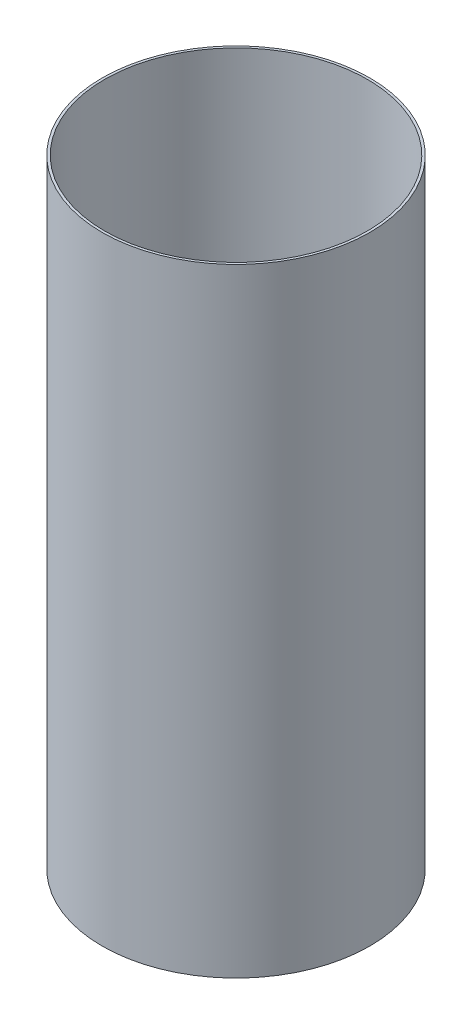
ISO-10303-21;
HEADER;
FILE_DESCRIPTION(('STEP AP214'),'2;1');
FILE_NAME('part.step','',(''),(''),'','','');
FILE_SCHEMA(('AUTOMOTIVE_DESIGN { 1 0 10303 214 1 1 1 1 }'));
ENDSEC;
DATA;
#1=APPLICATION_CONTEXT('core data for automotive mechanical design processes');
#2=APPLICATION_PROTOCOL_DEFINITION('international standard','automotive_design',2000,#1);
#3=PRODUCT_CONTEXT('',#1,'mechanical');
#4=PRODUCT('Part','Part','',(#3));
#5=PRODUCT_RELATED_PRODUCT_CATEGORY('part','',(#4));
#6=PRODUCT_DEFINITION_FORMATION('','',#4);
#7=PRODUCT_DEFINITION_CONTEXT('part definition',#1,'design');
#8=PRODUCT_DEFINITION('design','',#6,#7);
#9=PRODUCT_DEFINITION_SHAPE('','',#8);
#10=(LENGTH_UNIT() NAMED_UNIT(*) SI_UNIT(.MILLI.,.METRE.));
#11=(NAMED_UNIT(*) PLANE_ANGLE_UNIT() SI_UNIT($,.RADIAN.));
#12=(NAMED_UNIT(*) SI_UNIT($,.STERADIAN.) SOLID_ANGLE_UNIT());
#13=UNCERTAINTY_MEASURE_WITH_UNIT(LENGTH_MEASURE(1.E-05),#10,'distance_accuracy_value','');
#14=(GEOMETRIC_REPRESENTATION_CONTEXT(3) GLOBAL_UNCERTAINTY_ASSIGNED_CONTEXT((#13)) GLOBAL_UNIT_ASSIGNED_CONTEXT((#10,
#11,#12)) REPRESENTATION_CONTEXT('',''));
#15=CARTESIAN_POINT('',(0.,0.,0.));
#16=DIRECTION('',(0.,0.,1.));
#17=DIRECTION('',(1.,0.,0.));
#18=AXIS2_PLACEMENT_3D('',#15,#16,#17);
#19=CARTESIAN_POINT('',(0.,254.,0.));
#20=DIRECTION('',(0.,1.,0.));
#21=DIRECTION('',(0.,0.,1.));
#22=AXIS2_PLACEMENT_3D('',#19,#20,#21);
#23=PLANE('',#22);
#24=CARTESIAN_POINT('',(0.,254.,0.));
#25=DIRECTION('',(0.,1.,0.));
#26=DIRECTION('',(0.,0.,1.));
#27=AXIS2_PLACEMENT_3D('',#24,#25,#26);
#28=CIRCLE('',#27,55.);
#29=CARTESIAN_POINT('',(0.,254.,55.));
#30=VERTEX_POINT('',#29);
#31=EDGE_CURVE('E10',#30,#30,#28,.T.);
#32=ORIENTED_EDGE('',*,*,#31,.T.);
#33=EDGE_LOOP('',(#32));
#34=FACE_BOUND('',#33,.T.);
#35=CARTESIAN_POINT('',(0.,254.,0.));
#36=DIRECTION('',(0.,1.,0.));
#37=DIRECTION('',(0.,0.,1.));
#38=AXIS2_PLACEMENT_3D('',#35,#36,#37);
#39=CIRCLE('',#38,54.);
#40=CARTESIAN_POINT('',(0.,254.,54.));
#41=VERTEX_POINT('',#40);
#42=EDGE_CURVE('E49',#41,#41,#39,.T.);
#43=ORIENTED_EDGE('',*,*,#42,.F.);
#44=EDGE_LOOP('',(#43));
#45=FACE_BOUND('',#44,.T.);
#46=ADVANCED_FACE('F38',(#34,#45),#23,.T.);
#47=CARTESIAN_POINT('',(0.,0.,0.));
#48=DIRECTION('',(0.,1.,0.));
#49=DIRECTION('',(0.,0.,1.));
#50=AXIS2_PLACEMENT_3D('',#47,#48,#49);
#51=PLANE('',#50);
#52=CARTESIAN_POINT('',(0.,0.,0.));
#53=DIRECTION('',(0.,1.,0.));
#54=DIRECTION('',(0.,0.,1.));
#55=AXIS2_PLACEMENT_3D('',#52,#53,#54);
#56=CIRCLE('',#55,55.);
#57=CARTESIAN_POINT('',(0.,0.,55.));
#58=VERTEX_POINT('',#57);
#59=EDGE_CURVE('E42',#58,#58,#56,.T.);
#60=ORIENTED_EDGE('',*,*,#59,.F.);
#61=EDGE_LOOP('',(#60));
#62=FACE_BOUND('',#61,.T.);
#63=CARTESIAN_POINT('',(0.,0.,0.));
#64=DIRECTION('',(0.,1.,0.));
#65=DIRECTION('',(0.,0.,1.));
#66=AXIS2_PLACEMENT_3D('',#63,#64,#65);
#67=CIRCLE('',#66,54.);
#68=CARTESIAN_POINT('',(0.,0.,54.));
#69=VERTEX_POINT('',#68);
#70=EDGE_CURVE('E51',#69,#69,#67,.T.);
#71=ORIENTED_EDGE('',*,*,#70,.T.);
#72=EDGE_LOOP('',(#71));
#73=FACE_BOUND('',#72,.T.);
#74=ADVANCED_FACE('F61',(#62,#73),#51,.F.);
#75=CARTESIAN_POINT('',(0.,254.,0.));
#76=DIRECTION('',(0.,-1.,0.));
#77=DIRECTION('',(0.,0.,-1.));
#78=AXIS2_PLACEMENT_3D('',#75,#76,#77);
#79=CYLINDRICAL_SURFACE('',#78,55.);
#80=ORIENTED_EDGE('',*,*,#31,.F.);
#81=EDGE_LOOP('',(#80));
#82=FACE_BOUND('',#81,.T.);
#83=ORIENTED_EDGE('',*,*,#59,.T.);
#84=EDGE_LOOP('',(#83));
#85=FACE_BOUND('',#84,.T.);
#86=ADVANCED_FACE('F40',(#82,#85),#79,.T.);
#87=CARTESIAN_POINT('',(0.,254.,0.));
#88=DIRECTION('',(0.,-1.,0.));
#89=DIRECTION('',(0.,0.,-1.));
#90=AXIS2_PLACEMENT_3D('',#87,#88,#89);
#91=CYLINDRICAL_SURFACE('',#90,54.);
#92=ORIENTED_EDGE('',*,*,#42,.T.);
#93=EDGE_LOOP('',(#92));
#94=FACE_BOUND('',#93,.T.);
#95=ORIENTED_EDGE('',*,*,#70,.F.);
#96=EDGE_LOOP('',(#95));
#97=FACE_BOUND('',#96,.T.);
#98=ADVANCED_FACE('F57',(#94,#97),#91,.F.);
#99=CLOSED_SHELL('',(#46,#74,#86,#98));
#100=MANIFOLD_SOLID_BREP('B2',#99);
#101=ADVANCED_BREP_SHAPE_REPRESENTATION('',(#18,#100),#14);
#102=SHAPE_DEFINITION_REPRESENTATION(#9,#101);
ENDSEC;
END-ISO-10303-21;
